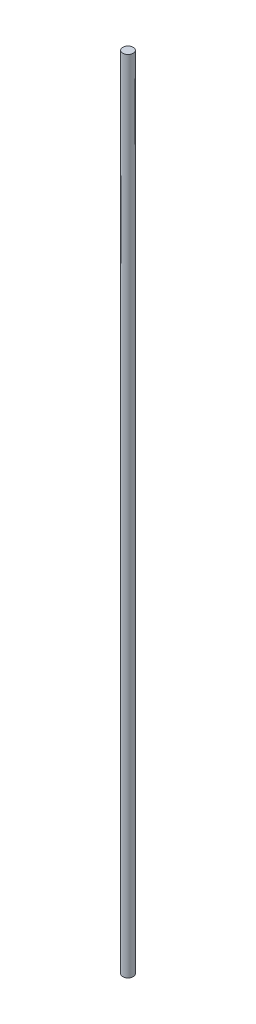
ISO-10303-21;
HEADER;
FILE_DESCRIPTION(('STEP AP214'),'2;1');
FILE_NAME('part.step','',(''),(''),'','','');
FILE_SCHEMA(('AUTOMOTIVE_DESIGN { 1 0 10303 214 1 1 1 1 }'));
ENDSEC;
DATA;
#1=APPLICATION_CONTEXT('core data for automotive mechanical design processes');
#2=APPLICATION_PROTOCOL_DEFINITION('international standard','automotive_design',2000,#1);
#3=PRODUCT_CONTEXT('',#1,'mechanical');
#4=PRODUCT('Part','Part','',(#3));
#5=PRODUCT_RELATED_PRODUCT_CATEGORY('part','',(#4));
#6=PRODUCT_DEFINITION_FORMATION('','',#4);
#7=PRODUCT_DEFINITION_CONTEXT('part definition',#1,'design');
#8=PRODUCT_DEFINITION('design','',#6,#7);
#9=PRODUCT_DEFINITION_SHAPE('','',#8);
#10=(LENGTH_UNIT() NAMED_UNIT(*) SI_UNIT(.MILLI.,.METRE.));
#11=(NAMED_UNIT(*) PLANE_ANGLE_UNIT() SI_UNIT($,.RADIAN.));
#12=(NAMED_UNIT(*) SI_UNIT($,.STERADIAN.) SOLID_ANGLE_UNIT());
#13=UNCERTAINTY_MEASURE_WITH_UNIT(LENGTH_MEASURE(1.E-05),#10,'distance_accuracy_value','');
#14=(GEOMETRIC_REPRESENTATION_CONTEXT(3) GLOBAL_UNCERTAINTY_ASSIGNED_CONTEXT((#13)) GLOBAL_UNIT_ASSIGNED_CONTEXT((#10,
#11,#12)) REPRESENTATION_CONTEXT('',''));
#15=CARTESIAN_POINT('',(0.,0.,0.));
#16=DIRECTION('',(0.,0.,1.));
#17=DIRECTION('',(1.,0.,0.));
#18=AXIS2_PLACEMENT_3D('',#15,#16,#17);
#19=CARTESIAN_POINT('',(0.,980.,0.));
#20=DIRECTION('',(0.,-1.,0.));
#21=DIRECTION('',(0.,0.,-1.));
#22=AXIS2_PLACEMENT_3D('',#19,#20,#21);
#23=CYLINDRICAL_SURFACE('',#22,6.35);
#24=CARTESIAN_POINT('',(0.,980.,0.));
#25=DIRECTION('',(0.,1.,0.));
#26=DIRECTION('',(0.,0.,1.));
#27=AXIS2_PLACEMENT_3D('',#24,#25,#26);
#28=CIRCLE('',#27,6.35);
#29=CARTESIAN_POINT('',(0.,980.,6.35));
#30=VERTEX_POINT('',#29);
#31=EDGE_CURVE('E10',#30,#30,#28,.T.);
#32=ORIENTED_EDGE('',*,*,#31,.F.);
#33=EDGE_LOOP('',(#32));
#34=FACE_BOUND('',#33,.T.);
#35=CARTESIAN_POINT('',(0.,0.,0.));
#36=DIRECTION('',(0.,1.,0.));
#37=DIRECTION('',(0.,0.,1.));
#38=AXIS2_PLACEMENT_3D('',#35,#36,#37);
#39=CIRCLE('',#38,6.35);
#40=CARTESIAN_POINT('',(0.,0.,6.35));
#41=VERTEX_POINT('',#40);
#42=EDGE_CURVE('E34',#41,#41,#39,.T.);
#43=ORIENTED_EDGE('',*,*,#42,.T.);
#44=EDGE_LOOP('',(#43));
#45=FACE_BOUND('',#44,.T.);
#46=ADVANCED_FACE('F31',(#34,#45),#23,.T.);
#47=CARTESIAN_POINT('',(0.,980.,0.));
#48=DIRECTION('',(0.,1.,0.));
#49=DIRECTION('',(0.,0.,1.));
#50=AXIS2_PLACEMENT_3D('',#47,#48,#49);
#51=PLANE('',#50);
#52=ORIENTED_EDGE('',*,*,#31,.T.);
#53=EDGE_LOOP('',(#52));
#54=FACE_BOUND('',#53,.T.);
#55=ADVANCED_FACE('F46',(#54),#51,.T.);
#56=CARTESIAN_POINT('',(0.,0.,0.));
#57=DIRECTION('',(0.,1.,0.));
#58=DIRECTION('',(0.,0.,1.));
#59=AXIS2_PLACEMENT_3D('',#56,#57,#58);
#60=PLANE('',#59);
#61=ORIENTED_EDGE('',*,*,#42,.F.);
#62=EDGE_LOOP('',(#61));
#63=FACE_BOUND('',#62,.T.);
#64=ADVANCED_FACE('F44',(#63),#60,.F.);
#65=CLOSED_SHELL('',(#46,#55,#64));
#66=MANIFOLD_SOLID_BREP('B2',#65);
#67=ADVANCED_BREP_SHAPE_REPRESENTATION('',(#18,#66),#14);
#68=SHAPE_DEFINITION_REPRESENTATION(#9,#67);
ENDSEC;
END-ISO-10303-21;
